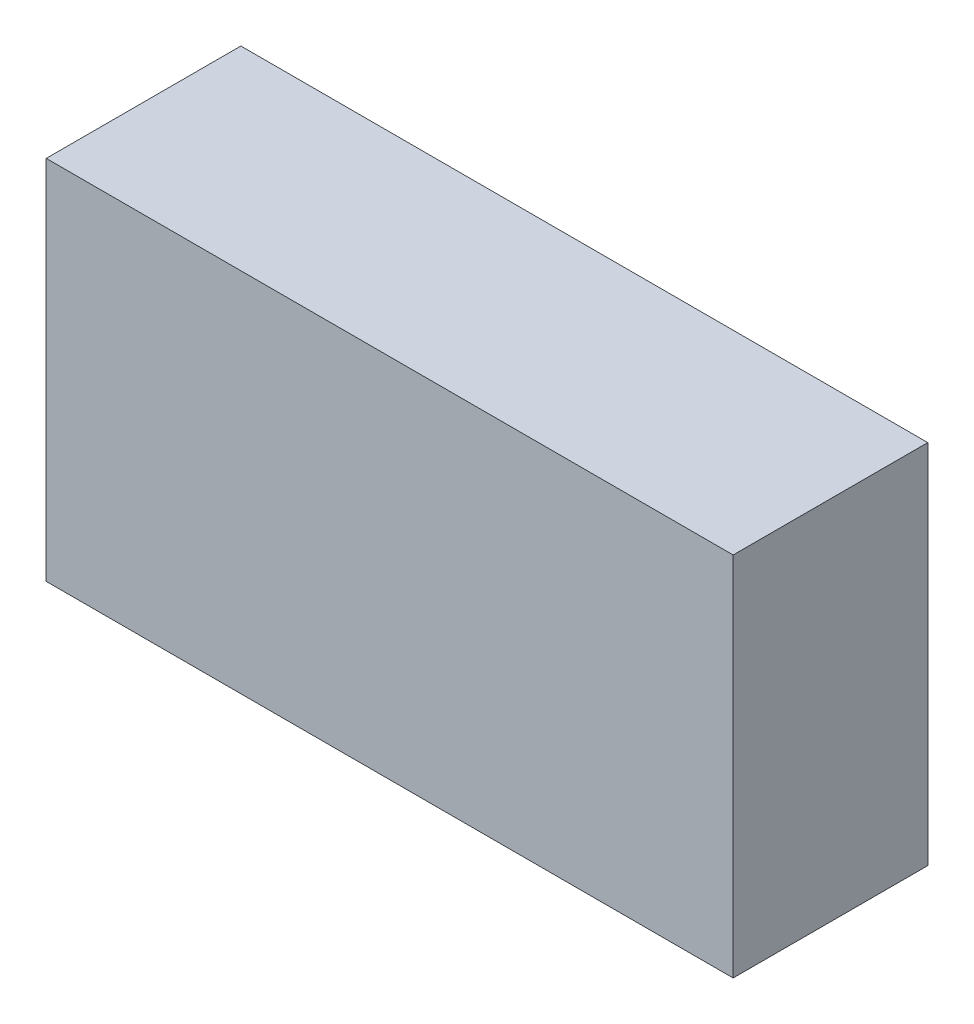
ISO-10303-21;
HEADER;
FILE_DESCRIPTION(('STEP AP214'),'2;1');
FILE_NAME('part.step','',(''),(''),'','','');
FILE_SCHEMA(('AUTOMOTIVE_DESIGN { 1 0 10303 214 1 1 1 1 }'));
ENDSEC;
DATA;
#1=APPLICATION_CONTEXT('core data for automotive mechanical design processes');
#2=APPLICATION_PROTOCOL_DEFINITION('international standard','automotive_design',2000,#1);
#3=PRODUCT_CONTEXT('',#1,'mechanical');
#4=PRODUCT('Part','Part','',(#3));
#5=PRODUCT_RELATED_PRODUCT_CATEGORY('part','',(#4));
#6=PRODUCT_DEFINITION_FORMATION('','',#4);
#7=PRODUCT_DEFINITION_CONTEXT('part definition',#1,'design');
#8=PRODUCT_DEFINITION('design','',#6,#7);
#9=PRODUCT_DEFINITION_SHAPE('','',#8);
#10=(LENGTH_UNIT() NAMED_UNIT(*) SI_UNIT(.MILLI.,.METRE.));
#11=(NAMED_UNIT(*) PLANE_ANGLE_UNIT() SI_UNIT($,.RADIAN.));
#12=(NAMED_UNIT(*) SI_UNIT($,.STERADIAN.) SOLID_ANGLE_UNIT());
#13=UNCERTAINTY_MEASURE_WITH_UNIT(LENGTH_MEASURE(1.E-05),#10,'distance_accuracy_value','');
#14=(GEOMETRIC_REPRESENTATION_CONTEXT(3) GLOBAL_UNCERTAINTY_ASSIGNED_CONTEXT((#13)) GLOBAL_UNIT_ASSIGNED_CONTEXT((#10,
#11,#12)) REPRESENTATION_CONTEXT('',''));
#15=CARTESIAN_POINT('',(0.,0.,0.));
#16=DIRECTION('',(0.,0.,1.));
#17=DIRECTION('',(1.,0.,0.));
#18=AXIS2_PLACEMENT_3D('',#15,#16,#17);
#19=CARTESIAN_POINT('',(-0.75000104,-0.3999992,0.42499788));
#20=DIRECTION('',(0.,0.,-1.));
#21=DIRECTION('',(0.,-1.,0.));
#22=AXIS2_PLACEMENT_3D('',#19,#20,#21);
#23=PLANE('',#22);
#24=DIRECTION('',(1.,0.,0.));
#25=VECTOR('',#24,1.);
#26=CARTESIAN_POINT('',(-0.75000104,-0.3999992,0.42499788));
#27=LINE('',#26,#25);
#28=CARTESIAN_POINT('',(-0.75000104,-0.3999992,0.42499788));
#29=VERTEX_POINT('',#28);
#30=CARTESIAN_POINT('',(0.75000104,-0.3999992,0.42499788));
#31=VERTEX_POINT('',#30);
#32=EDGE_CURVE('E99',#29,#31,#27,.T.);
#33=ORIENTED_EDGE('',*,*,#32,.T.);
#34=DIRECTION('',(0.,1.,0.));
#35=VECTOR('',#34,1.);
#36=CARTESIAN_POINT('',(0.75000104,-0.3999992,0.42499788));
#37=LINE('',#36,#35);
#38=CARTESIAN_POINT('',(0.75000104,0.3999992,0.42499788));
#39=VERTEX_POINT('',#38);
#40=EDGE_CURVE('E69',#31,#39,#37,.T.);
#41=ORIENTED_EDGE('',*,*,#40,.T.);
#42=DIRECTION('',(-1.,0.,0.));
#43=VECTOR('',#42,1.);
#44=CARTESIAN_POINT('',(0.75000104,0.3999992,0.42499788));
#45=LINE('',#44,#43);
#46=CARTESIAN_POINT('',(-0.75000104,0.3999992,0.42499788));
#47=VERTEX_POINT('',#46);
#48=EDGE_CURVE('E90',#39,#47,#45,.T.);
#49=ORIENTED_EDGE('',*,*,#48,.T.);
#50=DIRECTION('',(0.,-1.,0.));
#51=VECTOR('',#50,1.);
#52=CARTESIAN_POINT('',(-0.75000104,0.3999992,0.42499788));
#53=LINE('',#52,#51);
#54=EDGE_CURVE('E11',#47,#29,#53,.T.);
#55=ORIENTED_EDGE('',*,*,#54,.T.);
#56=EDGE_LOOP('',(#33,#41,#49,#55));
#57=FACE_BOUND('',#56,.T.);
#58=ADVANCED_FACE('F17',(#57),#23,.F.);
#59=CARTESIAN_POINT('',(-0.75000104,-0.3999992,0.));
#60=DIRECTION('',(0.,0.,-1.));
#61=DIRECTION('',(0.,-1.,0.));
#62=AXIS2_PLACEMENT_3D('',#59,#60,#61);
#63=PLANE('',#62);
#64=DIRECTION('',(1.,0.,0.));
#65=VECTOR('',#64,1.);
#66=CARTESIAN_POINT('',(-0.75000104,-0.3999992,0.));
#67=LINE('',#66,#65);
#68=CARTESIAN_POINT('',(-0.75000104,-0.3999992,0.));
#69=VERTEX_POINT('',#68);
#70=CARTESIAN_POINT('',(0.75000104,-0.3999992,0.));
#71=VERTEX_POINT('',#70);
#72=EDGE_CURVE('E21',#69,#71,#67,.T.);
#73=ORIENTED_EDGE('',*,*,#72,.F.);
#74=DIRECTION('',(0.,-1.,0.));
#75=VECTOR('',#74,1.);
#76=CARTESIAN_POINT('',(-0.75000104,0.3999992,0.));
#77=LINE('',#76,#75);
#78=CARTESIAN_POINT('',(-0.75000104,0.3999992,0.));
#79=VERTEX_POINT('',#78);
#80=EDGE_CURVE('E28',#79,#69,#77,.T.);
#81=ORIENTED_EDGE('',*,*,#80,.F.);
#82=DIRECTION('',(-1.,0.,0.));
#83=VECTOR('',#82,1.);
#84=CARTESIAN_POINT('',(0.75000104,0.3999992,0.));
#85=LINE('',#84,#83);
#86=CARTESIAN_POINT('',(0.75000104,0.3999992,0.));
#87=VERTEX_POINT('',#86);
#88=EDGE_CURVE('E56',#87,#79,#85,.T.);
#89=ORIENTED_EDGE('',*,*,#88,.F.);
#90=DIRECTION('',(0.,1.,0.));
#91=VECTOR('',#90,1.);
#92=CARTESIAN_POINT('',(0.75000104,-0.3999992,0.));
#93=LINE('',#92,#91);
#94=EDGE_CURVE('E76',#71,#87,#93,.T.);
#95=ORIENTED_EDGE('',*,*,#94,.F.);
#96=EDGE_LOOP('',(#73,#81,#89,#95));
#97=FACE_BOUND('',#96,.T.);
#98=ADVANCED_FACE('F93',(#97),#63,.T.);
#99=CARTESIAN_POINT('',(-0.75000104,0.3999992,0.));
#100=DIRECTION('',(1.,0.,0.));
#101=DIRECTION('',(0.,1.,0.));
#102=AXIS2_PLACEMENT_3D('',#99,#100,#101);
#103=PLANE('',#102);
#104=DIRECTION('',(0.,0.,1.));
#105=VECTOR('',#104,1.);
#106=CARTESIAN_POINT('',(-0.75000104,0.3999992,0.));
#107=LINE('',#106,#105);
#108=EDGE_CURVE('E88',#79,#47,#107,.T.);
#109=ORIENTED_EDGE('',*,*,#108,.F.);
#110=ORIENTED_EDGE('',*,*,#80,.T.);
#111=DIRECTION('',(0.,0.,1.));
#112=VECTOR('',#111,1.);
#113=CARTESIAN_POINT('',(-0.75000104,-0.3999992,0.));
#114=LINE('',#113,#112);
#115=EDGE_CURVE('E86',#69,#29,#114,.T.);
#116=ORIENTED_EDGE('',*,*,#115,.T.);
#117=ORIENTED_EDGE('',*,*,#54,.F.);
#118=EDGE_LOOP('',(#109,#110,#116,#117));
#119=FACE_BOUND('',#118,.T.);
#120=ADVANCED_FACE('F84',(#119),#103,.F.);
#121=CARTESIAN_POINT('',(0.75000104,0.3999992,0.));
#122=DIRECTION('',(0.,-1.,0.));
#123=DIRECTION('',(0.,0.,-1.));
#124=AXIS2_PLACEMENT_3D('',#121,#122,#123);
#125=PLANE('',#124);
#126=DIRECTION('',(0.,0.,1.));
#127=VECTOR('',#126,1.);
#128=CARTESIAN_POINT('',(0.75000104,0.3999992,0.));
#129=LINE('',#128,#127);
#130=EDGE_CURVE('E111',#87,#39,#129,.T.);
#131=ORIENTED_EDGE('',*,*,#130,.F.);
#132=ORIENTED_EDGE('',*,*,#88,.T.);
#133=ORIENTED_EDGE('',*,*,#108,.T.);
#134=ORIENTED_EDGE('',*,*,#48,.F.);
#135=EDGE_LOOP('',(#131,#132,#133,#134));
#136=FACE_BOUND('',#135,.T.);
#137=ADVANCED_FACE('F124',(#136),#125,.F.);
#138=CARTESIAN_POINT('',(0.75000104,-0.3999992,0.));
#139=DIRECTION('',(-1.,0.,0.));
#140=DIRECTION('',(0.,0.,1.));
#141=AXIS2_PLACEMENT_3D('',#138,#139,#140);
#142=PLANE('',#141);
#143=DIRECTION('',(0.,0.,1.));
#144=VECTOR('',#143,1.);
#145=CARTESIAN_POINT('',(0.75000104,-0.3999992,0.));
#146=LINE('',#145,#144);
#147=EDGE_CURVE('E97',#71,#31,#146,.T.);
#148=ORIENTED_EDGE('',*,*,#147,.F.);
#149=ORIENTED_EDGE('',*,*,#94,.T.);
#150=ORIENTED_EDGE('',*,*,#130,.T.);
#151=ORIENTED_EDGE('',*,*,#40,.F.);
#152=EDGE_LOOP('',(#148,#149,#150,#151));
#153=FACE_BOUND('',#152,.T.);
#154=ADVANCED_FACE('F19',(#153),#142,.F.);
#155=CARTESIAN_POINT('',(-0.75000104,-0.3999992,0.));
#156=DIRECTION('',(0.,1.,0.));
#157=DIRECTION('',(1.,0.,0.));
#158=AXIS2_PLACEMENT_3D('',#155,#156,#157);
#159=PLANE('',#158);
#160=ORIENTED_EDGE('',*,*,#115,.F.);
#161=ORIENTED_EDGE('',*,*,#72,.T.);
#162=ORIENTED_EDGE('',*,*,#147,.T.);
#163=ORIENTED_EDGE('',*,*,#32,.F.);
#164=EDGE_LOOP('',(#160,#161,#162,#163));
#165=FACE_BOUND('',#164,.T.);
#166=ADVANCED_FACE('F98',(#165),#159,.F.);
#167=CLOSED_SHELL('',(#58,#98,#120,#137,#154,#166));
#168=MANIFOLD_SOLID_BREP('B1',#167);
#169=ADVANCED_BREP_SHAPE_REPRESENTATION('',(#18,#168),#14);
#170=SHAPE_DEFINITION_REPRESENTATION(#9,#169);
ENDSEC;
END-ISO-10303-21;
